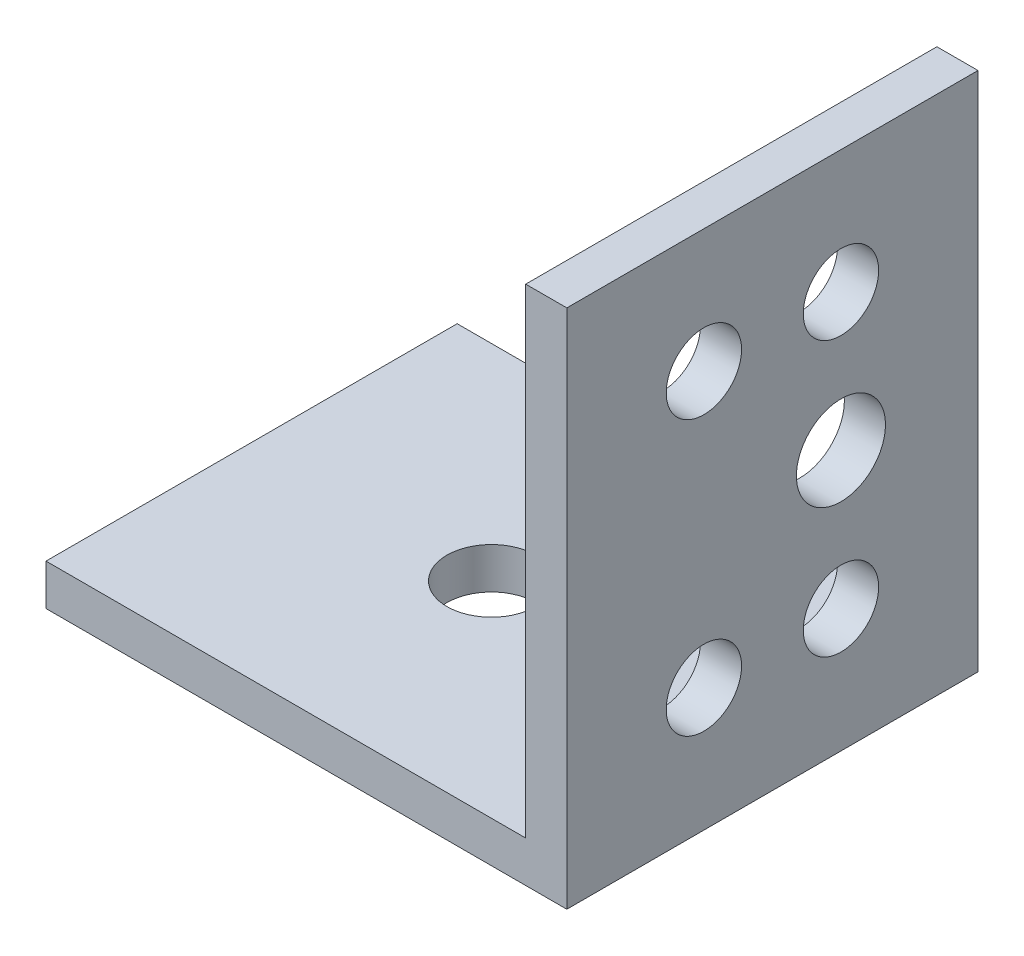
ISO-10303-21;
HEADER;
FILE_DESCRIPTION(('STEP AP214'),'2;1');
FILE_NAME('part.step','',(''),(''),'','','');
FILE_SCHEMA(('AUTOMOTIVE_DESIGN { 1 0 10303 214 1 1 1 1 }'));
ENDSEC;
DATA;
#1=APPLICATION_CONTEXT('core data for automotive mechanical design processes');
#2=APPLICATION_PROTOCOL_DEFINITION('international standard','automotive_design',2000,#1);
#3=PRODUCT_CONTEXT('',#1,'mechanical');
#4=PRODUCT('Part','Part','',(#3));
#5=PRODUCT_RELATED_PRODUCT_CATEGORY('part','',(#4));
#6=PRODUCT_DEFINITION_FORMATION('','',#4);
#7=PRODUCT_DEFINITION_CONTEXT('part definition',#1,'design');
#8=PRODUCT_DEFINITION('design','',#6,#7);
#9=PRODUCT_DEFINITION_SHAPE('','',#8);
#10=(LENGTH_UNIT() NAMED_UNIT(*) SI_UNIT(.MILLI.,.METRE.));
#11=(NAMED_UNIT(*) PLANE_ANGLE_UNIT() SI_UNIT($,.RADIAN.));
#12=(NAMED_UNIT(*) SI_UNIT($,.STERADIAN.) SOLID_ANGLE_UNIT());
#13=UNCERTAINTY_MEASURE_WITH_UNIT(LENGTH_MEASURE(1.E-05),#10,'distance_accuracy_value','');
#14=(GEOMETRIC_REPRESENTATION_CONTEXT(3) GLOBAL_UNCERTAINTY_ASSIGNED_CONTEXT((#13)) GLOBAL_UNIT_ASSIGNED_CONTEXT((#10,
#11,#12)) REPRESENTATION_CONTEXT('',''));
#15=CARTESIAN_POINT('',(0.,0.,0.));
#16=DIRECTION('',(0.,0.,1.));
#17=DIRECTION('',(1.,0.,0.));
#18=AXIS2_PLACEMENT_3D('',#15,#16,#17);
#19=CARTESIAN_POINT('',(0.,0.,30.));
#20=DIRECTION('',(0.,1.,0.));
#21=DIRECTION('',(-1.,0.,0.));
#22=AXIS2_PLACEMENT_3D('',#19,#20,#21);
#23=PLANE('',#22);
#24=CARTESIAN_POINT('',(-20.5,0.,15.));
#25=DIRECTION('',(0.,1.,0.));
#26=DIRECTION('',(-1.,0.,0.));
#27=AXIS2_PLACEMENT_3D('',#24,#25,#26);
#28=CIRCLE('',#27,3.25);
#29=CARTESIAN_POINT('',(-23.75,0.,15.));
#30=VERTEX_POINT('',#29);
#31=EDGE_CURVE('E163',#30,#30,#28,.F.);
#32=ORIENTED_EDGE('',*,*,#31,.F.);
#33=EDGE_LOOP('',(#32));
#34=FACE_BOUND('',#33,.T.);
#35=DIRECTION('',(1.,0.,0.));
#36=VECTOR('',#35,1.);
#37=CARTESIAN_POINT('',(0.,0.,0.));
#38=LINE('',#37,#36);
#39=CARTESIAN_POINT('',(-38.,0.,0.));
#40=VERTEX_POINT('',#39);
#41=CARTESIAN_POINT('',(0.,0.,0.));
#42=VERTEX_POINT('',#41);
#43=EDGE_CURVE('E119',#40,#42,#38,.T.);
#44=ORIENTED_EDGE('',*,*,#43,.T.);
#45=DIRECTION('',(0.,0.,-1.));
#46=VECTOR('',#45,1.);
#47=CARTESIAN_POINT('',(0.,0.,30.));
#48=LINE('',#47,#46);
#49=CARTESIAN_POINT('',(0.,0.,30.));
#50=VERTEX_POINT('',#49);
#51=EDGE_CURVE('E11',#50,#42,#48,.T.);
#52=ORIENTED_EDGE('',*,*,#51,.F.);
#53=DIRECTION('',(1.,0.,0.));
#54=VECTOR('',#53,1.);
#55=CARTESIAN_POINT('',(0.,0.,30.));
#56=LINE('',#55,#54);
#57=CARTESIAN_POINT('',(-38.,0.,30.));
#58=VERTEX_POINT('',#57);
#59=EDGE_CURVE('E130',#58,#50,#56,.T.);
#60=ORIENTED_EDGE('',*,*,#59,.F.);
#61=DIRECTION('',(0.,0.,-1.));
#62=VECTOR('',#61,1.);
#63=CARTESIAN_POINT('',(-38.,0.,30.));
#64=LINE('',#63,#62);
#65=EDGE_CURVE('E115',#58,#40,#64,.T.);
#66=ORIENTED_EDGE('',*,*,#65,.T.);
#67=EDGE_LOOP('',(#44,#52,#60,#66));
#68=FACE_BOUND('',#67,.T.);
#69=ADVANCED_FACE('F35',(#34,#68),#23,.F.);
#70=CARTESIAN_POINT('',(0.,0.,30.));
#71=DIRECTION('',(-1.,0.,0.));
#72=DIRECTION('',(0.,0.,1.));
#73=AXIS2_PLACEMENT_3D('',#70,#71,#72);
#74=PLANE('',#73);
#75=CARTESIAN_POINT('',(0.,19.,10.));
#76=DIRECTION('',(1.,0.,0.));
#77=DIRECTION('',(0.,0.,-1.));
#78=AXIS2_PLACEMENT_3D('',#75,#76,#77);
#79=CIRCLE('',#78,3.25);
#80=CARTESIAN_POINT('',(0.,19.,6.75));
#81=VERTEX_POINT('',#80);
#82=EDGE_CURVE('E174',#81,#81,#79,.T.);
#83=ORIENTED_EDGE('',*,*,#82,.F.);
#84=EDGE_LOOP('',(#83));
#85=FACE_BOUND('',#84,.T.);
#86=CARTESIAN_POINT('',(0.,9.,10.));
#87=DIRECTION('',(1.,0.,0.));
#88=DIRECTION('',(0.,0.,-1.));
#89=AXIS2_PLACEMENT_3D('',#86,#87,#88);
#90=CIRCLE('',#89,2.75);
#91=CARTESIAN_POINT('',(0.,9.,7.25));
#92=VERTEX_POINT('',#91);
#93=EDGE_CURVE('E182',#92,#92,#90,.T.);
#94=ORIENTED_EDGE('',*,*,#93,.F.);
#95=EDGE_LOOP('',(#94));
#96=FACE_BOUND('',#95,.T.);
#97=CARTESIAN_POINT('',(0.,29.,20.));
#98=DIRECTION('',(1.,0.,0.));
#99=DIRECTION('',(0.,0.,-1.));
#100=AXIS2_PLACEMENT_3D('',#97,#98,#99);
#101=CIRCLE('',#100,2.75);
#102=CARTESIAN_POINT('',(0.,29.,17.25));
#103=VERTEX_POINT('',#102);
#104=EDGE_CURVE('E188',#103,#103,#101,.T.);
#105=ORIENTED_EDGE('',*,*,#104,.F.);
#106=EDGE_LOOP('',(#105));
#107=FACE_BOUND('',#106,.T.);
#108=CARTESIAN_POINT('',(0.,9.,20.));
#109=DIRECTION('',(1.,0.,0.));
#110=DIRECTION('',(0.,0.,-1.));
#111=AXIS2_PLACEMENT_3D('',#108,#109,#110);
#112=CIRCLE('',#111,2.75);
#113=CARTESIAN_POINT('',(0.,9.,17.25));
#114=VERTEX_POINT('',#113);
#115=EDGE_CURVE('E165',#114,#114,#112,.T.);
#116=ORIENTED_EDGE('',*,*,#115,.F.);
#117=EDGE_LOOP('',(#116));
#118=FACE_BOUND('',#117,.T.);
#119=CARTESIAN_POINT('',(0.,29.,10.));
#120=DIRECTION('',(1.,0.,0.));
#121=DIRECTION('',(0.,0.,-1.));
#122=AXIS2_PLACEMENT_3D('',#119,#120,#121);
#123=CIRCLE('',#122,2.75);
#124=CARTESIAN_POINT('',(0.,29.,7.25));
#125=VERTEX_POINT('',#124);
#126=EDGE_CURVE('E181',#125,#125,#123,.T.);
#127=ORIENTED_EDGE('',*,*,#126,.F.);
#128=EDGE_LOOP('',(#127));
#129=FACE_BOUND('',#128,.T.);
#130=DIRECTION('',(0.,1.,0.));
#131=VECTOR('',#130,1.);
#132=CARTESIAN_POINT('',(0.,0.,0.));
#133=LINE('',#132,#131);
#134=CARTESIAN_POINT('',(0.,38.,0.));
#135=VERTEX_POINT('',#134);
#136=EDGE_CURVE('E122',#42,#135,#133,.T.);
#137=ORIENTED_EDGE('',*,*,#136,.T.);
#138=DIRECTION('',(0.,0.,-1.));
#139=VECTOR('',#138,1.);
#140=CARTESIAN_POINT('',(0.,38.,30.));
#141=LINE('',#140,#139);
#142=CARTESIAN_POINT('',(0.,38.,30.));
#143=VERTEX_POINT('',#142);
#144=EDGE_CURVE('E43',#143,#135,#141,.T.);
#145=ORIENTED_EDGE('',*,*,#144,.F.);
#146=DIRECTION('',(0.,1.,0.));
#147=VECTOR('',#146,1.);
#148=CARTESIAN_POINT('',(0.,0.,30.));
#149=LINE('',#148,#147);
#150=EDGE_CURVE('E88',#50,#143,#149,.T.);
#151=ORIENTED_EDGE('',*,*,#150,.F.);
#152=ORIENTED_EDGE('',*,*,#51,.T.);
#153=EDGE_LOOP('',(#137,#145,#151,#152));
#154=FACE_BOUND('',#153,.T.);
#155=ADVANCED_FACE('F155',(#85,#96,#107,#118,#129,#154),#74,.F.);
#156=CARTESIAN_POINT('',(-3.,38.,30.));
#157=DIRECTION('',(0.,-1.,0.));
#158=DIRECTION('',(0.,0.,-1.));
#159=AXIS2_PLACEMENT_3D('',#156,#157,#158);
#160=PLANE('',#159);
#161=DIRECTION('',(-1.,0.,0.));
#162=VECTOR('',#161,1.);
#163=CARTESIAN_POINT('',(-3.,38.,0.));
#164=LINE('',#163,#162);
#165=CARTESIAN_POINT('',(-3.,38.,0.));
#166=VERTEX_POINT('',#165);
#167=EDGE_CURVE('E125',#135,#166,#164,.T.);
#168=ORIENTED_EDGE('',*,*,#167,.T.);
#169=DIRECTION('',(0.,0.,-1.));
#170=VECTOR('',#169,1.);
#171=CARTESIAN_POINT('',(-3.,38.,30.));
#172=LINE('',#171,#170);
#173=CARTESIAN_POINT('',(-3.,38.,30.));
#174=VERTEX_POINT('',#173);
#175=EDGE_CURVE('E110',#174,#166,#172,.T.);
#176=ORIENTED_EDGE('',*,*,#175,.F.);
#177=DIRECTION('',(-1.,0.,0.));
#178=VECTOR('',#177,1.);
#179=CARTESIAN_POINT('',(-3.,38.,30.));
#180=LINE('',#179,#178);
#181=EDGE_CURVE('E101',#143,#174,#180,.T.);
#182=ORIENTED_EDGE('',*,*,#181,.F.);
#183=ORIENTED_EDGE('',*,*,#144,.T.);
#184=EDGE_LOOP('',(#168,#176,#182,#183));
#185=FACE_BOUND('',#184,.T.);
#186=ADVANCED_FACE('F136',(#185),#160,.F.);
#187=CARTESIAN_POINT('',(-3.,2.99999999999999,30.));
#188=DIRECTION('',(1.,0.,0.));
#189=DIRECTION('',(0.,0.,-1.));
#190=AXIS2_PLACEMENT_3D('',#187,#188,#189);
#191=PLANE('',#190);
#192=CARTESIAN_POINT('',(-3.,19.,10.));
#193=DIRECTION('',(1.,0.,0.));
#194=DIRECTION('',(0.,0.,-1.));
#195=AXIS2_PLACEMENT_3D('',#192,#193,#194);
#196=CIRCLE('',#195,3.25);
#197=CARTESIAN_POINT('',(-3.,19.,6.75));
#198=VERTEX_POINT('',#197);
#199=EDGE_CURVE('E177',#198,#198,#196,.F.);
#200=ORIENTED_EDGE('',*,*,#199,.F.);
#201=EDGE_LOOP('',(#200));
#202=FACE_BOUND('',#201,.T.);
#203=CARTESIAN_POINT('',(-3.,9.,10.));
#204=DIRECTION('',(1.,0.,0.));
#205=DIRECTION('',(0.,0.,-1.));
#206=AXIS2_PLACEMENT_3D('',#203,#204,#205);
#207=CIRCLE('',#206,2.75);
#208=CARTESIAN_POINT('',(-3.,9.,7.25));
#209=VERTEX_POINT('',#208);
#210=EDGE_CURVE('E178',#209,#209,#207,.F.);
#211=ORIENTED_EDGE('',*,*,#210,.F.);
#212=EDGE_LOOP('',(#211));
#213=FACE_BOUND('',#212,.T.);
#214=CARTESIAN_POINT('',(-3.,29.,20.));
#215=DIRECTION('',(1.,0.,0.));
#216=DIRECTION('',(0.,0.,-1.));
#217=AXIS2_PLACEMENT_3D('',#214,#215,#216);
#218=CIRCLE('',#217,2.75);
#219=CARTESIAN_POINT('',(-3.,29.,17.25));
#220=VERTEX_POINT('',#219);
#221=EDGE_CURVE('E185',#220,#220,#218,.F.);
#222=ORIENTED_EDGE('',*,*,#221,.F.);
#223=EDGE_LOOP('',(#222));
#224=FACE_BOUND('',#223,.T.);
#225=CARTESIAN_POINT('',(-3.,9.,20.));
#226=DIRECTION('',(1.,0.,0.));
#227=DIRECTION('',(0.,0.,-1.));
#228=AXIS2_PLACEMENT_3D('',#225,#226,#227);
#229=CIRCLE('',#228,2.75);
#230=CARTESIAN_POINT('',(-3.,9.,17.25));
#231=VERTEX_POINT('',#230);
#232=EDGE_CURVE('E169',#231,#231,#229,.F.);
#233=ORIENTED_EDGE('',*,*,#232,.F.);
#234=EDGE_LOOP('',(#233));
#235=FACE_BOUND('',#234,.T.);
#236=CARTESIAN_POINT('',(-3.,29.,10.));
#237=DIRECTION('',(1.,0.,0.));
#238=DIRECTION('',(0.,0.,-1.));
#239=AXIS2_PLACEMENT_3D('',#236,#237,#238);
#240=CIRCLE('',#239,2.75);
#241=CARTESIAN_POINT('',(-3.,29.,7.25));
#242=VERTEX_POINT('',#241);
#243=EDGE_CURVE('E123',#242,#242,#240,.F.);
#244=ORIENTED_EDGE('',*,*,#243,.F.);
#245=EDGE_LOOP('',(#244));
#246=FACE_BOUND('',#245,.T.);
#247=DIRECTION('',(0.,-1.,0.));
#248=VECTOR('',#247,1.);
#249=CARTESIAN_POINT('',(-3.,2.99999999999999,0.));
#250=LINE('',#249,#248);
#251=CARTESIAN_POINT('',(-3.,2.99999999999999,0.));
#252=VERTEX_POINT('',#251);
#253=EDGE_CURVE('E109',#166,#252,#250,.T.);
#254=ORIENTED_EDGE('',*,*,#253,.T.);
#255=DIRECTION('',(0.,0.,-1.));
#256=VECTOR('',#255,1.);
#257=CARTESIAN_POINT('',(-3.,2.99999999999999,30.));
#258=LINE('',#257,#256);
#259=CARTESIAN_POINT('',(-3.,2.99999999999999,30.));
#260=VERTEX_POINT('',#259);
#261=EDGE_CURVE('E106',#260,#252,#258,.T.);
#262=ORIENTED_EDGE('',*,*,#261,.F.);
#263=DIRECTION('',(0.,-1.,0.));
#264=VECTOR('',#263,1.);
#265=CARTESIAN_POINT('',(-3.,2.99999999999999,30.));
#266=LINE('',#265,#264);
#267=EDGE_CURVE('E95',#174,#260,#266,.T.);
#268=ORIENTED_EDGE('',*,*,#267,.F.);
#269=ORIENTED_EDGE('',*,*,#175,.T.);
#270=EDGE_LOOP('',(#254,#262,#268,#269));
#271=FACE_BOUND('',#270,.T.);
#272=ADVANCED_FACE('F107',(#202,#213,#224,#235,#246,#271),#191,.F.);
#273=CARTESIAN_POINT('',(-38.,3.,30.));
#274=DIRECTION('',(0.,-1.,0.));
#275=DIRECTION('',(1.,0.,0.));
#276=AXIS2_PLACEMENT_3D('',#273,#274,#275);
#277=PLANE('',#276);
#278=CARTESIAN_POINT('',(-20.5,2.99999999999999,15.));
#279=DIRECTION('',(0.,1.,0.));
#280=DIRECTION('',(-1.,0.,0.));
#281=AXIS2_PLACEMENT_3D('',#278,#279,#280);
#282=CIRCLE('',#281,3.25);
#283=CARTESIAN_POINT('',(-23.75,2.99999999999999,15.));
#284=VERTEX_POINT('',#283);
#285=EDGE_CURVE('E166',#284,#284,#282,.T.);
#286=ORIENTED_EDGE('',*,*,#285,.F.);
#287=EDGE_LOOP('',(#286));
#288=FACE_BOUND('',#287,.T.);
#289=DIRECTION('',(-1.,0.,0.));
#290=VECTOR('',#289,1.);
#291=CARTESIAN_POINT('',(-38.,3.,0.));
#292=LINE('',#291,#290);
#293=CARTESIAN_POINT('',(-38.,3.,0.));
#294=VERTEX_POINT('',#293);
#295=EDGE_CURVE('E74',#252,#294,#292,.T.);
#296=ORIENTED_EDGE('',*,*,#295,.T.);
#297=DIRECTION('',(0.,0.,-1.));
#298=VECTOR('',#297,1.);
#299=CARTESIAN_POINT('',(-38.,3.,30.));
#300=LINE('',#299,#298);
#301=CARTESIAN_POINT('',(-38.,3.,30.));
#302=VERTEX_POINT('',#301);
#303=EDGE_CURVE('E111',#302,#294,#300,.T.);
#304=ORIENTED_EDGE('',*,*,#303,.F.);
#305=DIRECTION('',(-1.,0.,0.));
#306=VECTOR('',#305,1.);
#307=CARTESIAN_POINT('',(-38.,3.,30.));
#308=LINE('',#307,#306);
#309=EDGE_CURVE('E99',#260,#302,#308,.T.);
#310=ORIENTED_EDGE('',*,*,#309,.F.);
#311=ORIENTED_EDGE('',*,*,#261,.T.);
#312=EDGE_LOOP('',(#296,#304,#310,#311));
#313=FACE_BOUND('',#312,.T.);
#314=ADVANCED_FACE('F113',(#288,#313),#277,.F.);
#315=CARTESIAN_POINT('',(-38.,0.,30.));
#316=DIRECTION('',(1.,0.,0.));
#317=DIRECTION('',(0.,0.,-1.));
#318=AXIS2_PLACEMENT_3D('',#315,#316,#317);
#319=PLANE('',#318);
#320=DIRECTION('',(0.,-1.,0.));
#321=VECTOR('',#320,1.);
#322=CARTESIAN_POINT('',(-38.,0.,0.));
#323=LINE('',#322,#321);
#324=EDGE_CURVE('E80',#294,#40,#323,.T.);
#325=ORIENTED_EDGE('',*,*,#324,.T.);
#326=ORIENTED_EDGE('',*,*,#65,.F.);
#327=DIRECTION('',(0.,-1.,0.));
#328=VECTOR('',#327,1.);
#329=CARTESIAN_POINT('',(-38.,0.,30.));
#330=LINE('',#329,#328);
#331=EDGE_CURVE('E51',#302,#58,#330,.T.);
#332=ORIENTED_EDGE('',*,*,#331,.F.);
#333=ORIENTED_EDGE('',*,*,#303,.T.);
#334=EDGE_LOOP('',(#325,#326,#332,#333));
#335=FACE_BOUND('',#334,.T.);
#336=ADVANCED_FACE('F143',(#335),#319,.F.);
#337=CARTESIAN_POINT('',(0.,0.,30.));
#338=DIRECTION('',(0.,0.,-1.));
#339=DIRECTION('',(-1.,0.,0.));
#340=AXIS2_PLACEMENT_3D('',#337,#338,#339);
#341=PLANE('',#340);
#342=ORIENTED_EDGE('',*,*,#59,.T.);
#343=ORIENTED_EDGE('',*,*,#150,.T.);
#344=ORIENTED_EDGE('',*,*,#181,.T.);
#345=ORIENTED_EDGE('',*,*,#267,.T.);
#346=ORIENTED_EDGE('',*,*,#309,.T.);
#347=ORIENTED_EDGE('',*,*,#331,.T.);
#348=EDGE_LOOP('',(#342,#343,#344,#345,#346,#347));
#349=FACE_BOUND('',#348,.T.);
#350=ADVANCED_FACE('F97',(#349),#341,.F.);
#351=CARTESIAN_POINT('',(0.,0.,0.));
#352=DIRECTION('',(0.,0.,-1.));
#353=DIRECTION('',(-1.,0.,0.));
#354=AXIS2_PLACEMENT_3D('',#351,#352,#353);
#355=PLANE('',#354);
#356=ORIENTED_EDGE('',*,*,#43,.F.);
#357=ORIENTED_EDGE('',*,*,#324,.F.);
#358=ORIENTED_EDGE('',*,*,#295,.F.);
#359=ORIENTED_EDGE('',*,*,#253,.F.);
#360=ORIENTED_EDGE('',*,*,#167,.F.);
#361=ORIENTED_EDGE('',*,*,#136,.F.);
#362=EDGE_LOOP('',(#356,#357,#358,#359,#360,#361));
#363=FACE_BOUND('',#362,.T.);
#364=ADVANCED_FACE('F139',(#363),#355,.T.);
#365=CARTESIAN_POINT('',(-38.001,29.,10.));
#366=DIRECTION('',(1.,0.,0.));
#367=DIRECTION('',(0.,0.,-1.));
#368=AXIS2_PLACEMENT_3D('',#365,#366,#367);
#369=CYLINDRICAL_SURFACE('',#368,2.75);
#370=ORIENTED_EDGE('',*,*,#126,.T.);
#371=EDGE_LOOP('',(#370));
#372=FACE_BOUND('',#371,.T.);
#373=ORIENTED_EDGE('',*,*,#243,.T.);
#374=EDGE_LOOP('',(#373));
#375=FACE_BOUND('',#374,.T.);
#376=ADVANCED_FACE('F202',(#372,#375),#369,.F.);
#377=CARTESIAN_POINT('',(-38.001,9.,20.));
#378=DIRECTION('',(1.,0.,0.));
#379=DIRECTION('',(0.,0.,-1.));
#380=AXIS2_PLACEMENT_3D('',#377,#378,#379);
#381=CYLINDRICAL_SURFACE('',#380,2.75);
#382=ORIENTED_EDGE('',*,*,#115,.T.);
#383=EDGE_LOOP('',(#382));
#384=FACE_BOUND('',#383,.T.);
#385=ORIENTED_EDGE('',*,*,#232,.T.);
#386=EDGE_LOOP('',(#385));
#387=FACE_BOUND('',#386,.T.);
#388=ADVANCED_FACE('F219',(#384,#387),#381,.F.);
#389=CARTESIAN_POINT('',(-38.001,29.,20.));
#390=DIRECTION('',(1.,0.,0.));
#391=DIRECTION('',(0.,0.,-1.));
#392=AXIS2_PLACEMENT_3D('',#389,#390,#391);
#393=CYLINDRICAL_SURFACE('',#392,2.75);
#394=ORIENTED_EDGE('',*,*,#104,.T.);
#395=EDGE_LOOP('',(#394));
#396=FACE_BOUND('',#395,.T.);
#397=ORIENTED_EDGE('',*,*,#221,.T.);
#398=EDGE_LOOP('',(#397));
#399=FACE_BOUND('',#398,.T.);
#400=ADVANCED_FACE('F221',(#396,#399),#393,.F.);
#401=CARTESIAN_POINT('',(-38.001,9.,10.));
#402=DIRECTION('',(1.,0.,0.));
#403=DIRECTION('',(0.,0.,-1.));
#404=AXIS2_PLACEMENT_3D('',#401,#402,#403);
#405=CYLINDRICAL_SURFACE('',#404,2.75);
#406=ORIENTED_EDGE('',*,*,#93,.T.);
#407=EDGE_LOOP('',(#406));
#408=FACE_BOUND('',#407,.T.);
#409=ORIENTED_EDGE('',*,*,#210,.T.);
#410=EDGE_LOOP('',(#409));
#411=FACE_BOUND('',#410,.T.);
#412=ADVANCED_FACE('F228',(#408,#411),#405,.F.);
#413=CARTESIAN_POINT('',(-38.001,19.,10.));
#414=DIRECTION('',(1.,0.,0.));
#415=DIRECTION('',(0.,0.,-1.));
#416=AXIS2_PLACEMENT_3D('',#413,#414,#415);
#417=CYLINDRICAL_SURFACE('',#416,3.25);
#418=ORIENTED_EDGE('',*,*,#82,.T.);
#419=EDGE_LOOP('',(#418));
#420=FACE_BOUND('',#419,.T.);
#421=ORIENTED_EDGE('',*,*,#199,.T.);
#422=EDGE_LOOP('',(#421));
#423=FACE_BOUND('',#422,.T.);
#424=ADVANCED_FACE('F265',(#420,#423),#417,.F.);
#425=CARTESIAN_POINT('',(-20.5,-0.00100000000000751,15.));
#426=DIRECTION('',(0.,1.,0.));
#427=DIRECTION('',(-1.,0.,0.));
#428=AXIS2_PLACEMENT_3D('',#425,#426,#427);
#429=CYLINDRICAL_SURFACE('',#428,3.25);
#430=ORIENTED_EDGE('',*,*,#285,.T.);
#431=EDGE_LOOP('',(#430));
#432=FACE_BOUND('',#431,.T.);
#433=ORIENTED_EDGE('',*,*,#31,.T.);
#434=EDGE_LOOP('',(#433));
#435=FACE_BOUND('',#434,.T.);
#436=ADVANCED_FACE('F273',(#432,#435),#429,.F.);
#437=CLOSED_SHELL('',(#69,#155,#186,#272,#314,#336,#350,#364,#376,#388,#400,#412,#424,#436));
#438=MANIFOLD_SOLID_BREP('B2',#437);
#439=ADVANCED_BREP_SHAPE_REPRESENTATION('',(#18,#438),#14);
#440=SHAPE_DEFINITION_REPRESENTATION(#9,#439);
ENDSEC;
END-ISO-10303-21;
